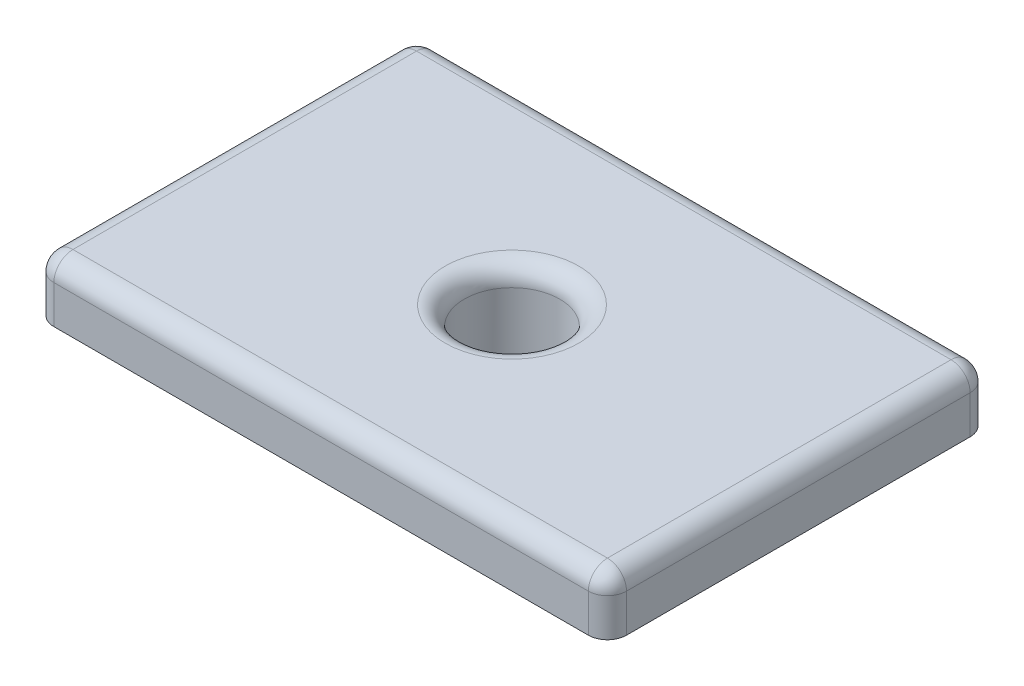
ISO-10303-21;
HEADER;
FILE_DESCRIPTION(('STEP AP214'),'2;1');
FILE_NAME('part.step','',(''),(''),'','','');
FILE_SCHEMA(('AUTOMOTIVE_DESIGN { 1 0 10303 214 1 1 1 1 }'));
ENDSEC;
DATA;
#1=APPLICATION_CONTEXT('core data for automotive mechanical design processes');
#2=APPLICATION_PROTOCOL_DEFINITION('international standard','automotive_design',2000,#1);
#3=PRODUCT_CONTEXT('',#1,'mechanical');
#4=PRODUCT('Part','Part','',(#3));
#5=PRODUCT_RELATED_PRODUCT_CATEGORY('part','',(#4));
#6=PRODUCT_DEFINITION_FORMATION('','',#4);
#7=PRODUCT_DEFINITION_CONTEXT('part definition',#1,'design');
#8=PRODUCT_DEFINITION('design','',#6,#7);
#9=PRODUCT_DEFINITION_SHAPE('','',#8);
#10=(LENGTH_UNIT() NAMED_UNIT(*) SI_UNIT(.MILLI.,.METRE.));
#11=(NAMED_UNIT(*) PLANE_ANGLE_UNIT() SI_UNIT($,.RADIAN.));
#12=(NAMED_UNIT(*) SI_UNIT($,.STERADIAN.) SOLID_ANGLE_UNIT());
#13=UNCERTAINTY_MEASURE_WITH_UNIT(LENGTH_MEASURE(1.E-05),#10,'distance_accuracy_value','');
#14=(GEOMETRIC_REPRESENTATION_CONTEXT(3) GLOBAL_UNCERTAINTY_ASSIGNED_CONTEXT((#13)) GLOBAL_UNIT_ASSIGNED_CONTEXT((#10,
#11,#12)) REPRESENTATION_CONTEXT('',''));
#15=CARTESIAN_POINT('',(0.,0.,0.));
#16=DIRECTION('',(0.,0.,1.));
#17=DIRECTION('',(1.,0.,0.));
#18=AXIS2_PLACEMENT_3D('',#15,#16,#17);
#19=CARTESIAN_POINT('',(5.43818539233098,2.67462627726309,3.13766362557271));
#20=DIRECTION('',(0.,1.,0.));
#21=DIRECTION('',(0.,0.,1.));
#22=AXIS2_PLACEMENT_3D('',#19,#20,#21);
#23=PLANE('',#22);
#24=CARTESIAN_POINT('',(5.43818539233098,2.67462627726309,3.13766362557271));
#25=DIRECTION('',(0.,1.,0.));
#26=DIRECTION('',(0.,0.,1.));
#27=AXIS2_PLACEMENT_3D('',#24,#25,#26);
#28=CIRCLE('',#27,0.5);
#29=CARTESIAN_POINT('',(5.43818539233098,2.67462627726309,3.63766362557271));
#30=VERTEX_POINT('',#29);
#31=CARTESIAN_POINT('',(5.93818539233098,2.67462627726309,3.13766362557271));
#32=VERTEX_POINT('',#31);
#33=EDGE_CURVE('E112',#30,#32,#28,.T.);
#34=ORIENTED_EDGE('',*,*,#33,.F.);
#35=DIRECTION('',(1.,0.,0.));
#36=VECTOR('',#35,1.);
#37=CARTESIAN_POINT('',(-8.56181460766902,2.67462627726309,3.63766362557271));
#38=LINE('',#37,#36);
#39=CARTESIAN_POINT('',(-8.56181460766902,2.67462627726309,3.63766362557271));
#40=VERTEX_POINT('',#39);
#41=EDGE_CURVE('E141',#40,#30,#38,.T.);
#42=ORIENTED_EDGE('',*,*,#41,.F.);
#43=CARTESIAN_POINT('',(-8.56181460766902,2.67462627726309,3.13766362557271));
#44=DIRECTION('',(0.,1.,0.));
#45=DIRECTION('',(0.,0.,1.));
#46=AXIS2_PLACEMENT_3D('',#43,#44,#45);
#47=CIRCLE('',#46,0.5);
#48=CARTESIAN_POINT('',(-9.06181460766902,2.67462627726309,3.13766362557271));
#49=VERTEX_POINT('',#48);
#50=EDGE_CURVE('E138',#49,#40,#47,.T.);
#51=ORIENTED_EDGE('',*,*,#50,.F.);
#52=DIRECTION('',(0.,0.,1.));
#53=VECTOR('',#52,1.);
#54=CARTESIAN_POINT('',(-9.06181460766902,2.67462627726309,-5.86233637442728));
#55=LINE('',#54,#53);
#56=CARTESIAN_POINT('',(-9.06181460766902,2.67462627726309,-5.86233637442728));
#57=VERTEX_POINT('',#56);
#58=EDGE_CURVE('E135',#57,#49,#55,.T.);
#59=ORIENTED_EDGE('',*,*,#58,.F.);
#60=CARTESIAN_POINT('',(-8.56181460766902,2.67462627726309,-5.86233637442729));
#61=DIRECTION('',(0.,1.,0.));
#62=DIRECTION('',(0.,0.,1.));
#63=AXIS2_PLACEMENT_3D('',#60,#61,#62);
#64=CIRCLE('',#63,0.5);
#65=CARTESIAN_POINT('',(-8.56181460766902,2.67462627726309,-6.36233637442729));
#66=VERTEX_POINT('',#65);
#67=EDGE_CURVE('E132',#66,#57,#64,.T.);
#68=ORIENTED_EDGE('',*,*,#67,.F.);
#69=DIRECTION('',(-1.,0.,0.));
#70=VECTOR('',#69,1.);
#71=CARTESIAN_POINT('',(-8.56181460766902,2.67462627726309,-6.36233637442729));
#72=LINE('',#71,#70);
#73=CARTESIAN_POINT('',(5.43818539233097,2.67462627726309,-6.36233637442729));
#74=VERTEX_POINT('',#73);
#75=EDGE_CURVE('E129',#74,#66,#72,.T.);
#76=ORIENTED_EDGE('',*,*,#75,.F.);
#77=CARTESIAN_POINT('',(5.43818539233098,2.67462627726309,-5.86233637442729));
#78=DIRECTION('',(0.,1.,0.));
#79=DIRECTION('',(0.,0.,-1.));
#80=AXIS2_PLACEMENT_3D('',#77,#78,#79);
#81=CIRCLE('',#80,0.5);
#82=CARTESIAN_POINT('',(5.93818539233098,2.67462627726309,-5.86233637442728));
#83=VERTEX_POINT('',#82);
#84=EDGE_CURVE('E115',#83,#74,#81,.T.);
#85=ORIENTED_EDGE('',*,*,#84,.F.);
#86=DIRECTION('',(0.,0.,-1.));
#87=VECTOR('',#86,1.);
#88=CARTESIAN_POINT('',(5.93818539233098,2.67462627726309,-5.86233637442728));
#89=LINE('',#88,#87);
#90=EDGE_CURVE('E98',#32,#83,#89,.T.);
#91=ORIENTED_EDGE('',*,*,#90,.F.);
#92=EDGE_LOOP('',(#34,#42,#51,#59,#68,#76,#85,#91));
#93=FACE_BOUND('',#92,.T.);
#94=CARTESIAN_POINT('',(-1.56181460766902,2.67462627726309,-1.36233637442728));
#95=DIRECTION('',(0.,1.,0.));
#96=DIRECTION('',(0.,0.,1.));
#97=AXIS2_PLACEMENT_3D('',#94,#95,#96);
#98=CIRCLE('',#97,3.);
#99=CARTESIAN_POINT('',(-1.56181460766902,2.67462627726309,1.63766362557272));
#100=VERTEX_POINT('',#99);
#101=EDGE_CURVE('E105',#100,#100,#98,.F.);
#102=ORIENTED_EDGE('',*,*,#101,.F.);
#103=EDGE_LOOP('',(#102));
#104=FACE_BOUND('',#103,.T.);
#105=ADVANCED_FACE('F16',(#93,#104),#23,.F.);
#106=CARTESIAN_POINT('',(5.43818539233098,4.17462627726309,3.13766362557271));
#107=DIRECTION('',(0.,-1.,0.));
#108=DIRECTION('',(0.,0.,-1.));
#109=AXIS2_PLACEMENT_3D('',#106,#107,#108);
#110=CYLINDRICAL_SURFACE('',#109,0.5);
#111=DIRECTION('',(0.,-1.,0.));
#112=VECTOR('',#111,1.);
#113=CARTESIAN_POINT('',(5.93818539233098,4.17462627726309,3.13766362557271));
#114=LINE('',#113,#112);
#115=CARTESIAN_POINT('',(5.93818539233098,3.67462627726309,3.13766362557271));
#116=VERTEX_POINT('',#115);
#117=EDGE_CURVE('E94',#116,#32,#114,.T.);
#118=ORIENTED_EDGE('',*,*,#117,.F.);
#119=CARTESIAN_POINT('',(5.43818539233098,3.67462627726309,3.13766362557271));
#120=DIRECTION('',(0.,-1.,0.));
#121=DIRECTION('',(0.,0.,-1.));
#122=AXIS2_PLACEMENT_3D('',#119,#120,#121);
#123=CIRCLE('',#122,0.5);
#124=CARTESIAN_POINT('',(5.43818539233098,3.67462627726309,3.63766362557271));
#125=VERTEX_POINT('',#124);
#126=EDGE_CURVE('E170',#116,#125,#123,.T.);
#127=ORIENTED_EDGE('',*,*,#126,.T.);
#128=DIRECTION('',(0.,-1.,0.));
#129=VECTOR('',#128,1.);
#130=CARTESIAN_POINT('',(5.43818539233098,4.17462627726309,3.63766362557271));
#131=LINE('',#130,#129);
#132=EDGE_CURVE('E119',#125,#30,#131,.T.);
#133=ORIENTED_EDGE('',*,*,#132,.T.);
#134=ORIENTED_EDGE('',*,*,#33,.T.);
#135=EDGE_LOOP('',(#118,#127,#133,#134));
#136=FACE_BOUND('',#135,.T.);
#137=ADVANCED_FACE('F117',(#136),#110,.T.);
#138=CARTESIAN_POINT('',(5.93818539233098,4.17462627726309,-5.86233637442728));
#139=DIRECTION('',(-1.,0.,0.));
#140=DIRECTION('',(0.,0.,1.));
#141=AXIS2_PLACEMENT_3D('',#138,#139,#140);
#142=PLANE('',#141);
#143=DIRECTION('',(0.,-1.,0.));
#144=VECTOR('',#143,1.);
#145=CARTESIAN_POINT('',(5.93818539233098,4.17462627726309,-5.86233637442728));
#146=LINE('',#145,#144);
#147=CARTESIAN_POINT('',(5.93818539233098,3.67462627726309,-5.86233637442728));
#148=VERTEX_POINT('',#147);
#149=EDGE_CURVE('E106',#148,#83,#146,.T.);
#150=ORIENTED_EDGE('',*,*,#149,.F.);
#151=DIRECTION('',(0.,0.,-1.));
#152=VECTOR('',#151,1.);
#153=CARTESIAN_POINT('',(5.93818539233098,3.67462627726309,3.13766362557271));
#154=LINE('',#153,#152);
#155=EDGE_CURVE('E101',#148,#116,#154,.F.);
#156=ORIENTED_EDGE('',*,*,#155,.T.);
#157=ORIENTED_EDGE('',*,*,#117,.T.);
#158=ORIENTED_EDGE('',*,*,#90,.T.);
#159=EDGE_LOOP('',(#150,#156,#157,#158));
#160=FACE_BOUND('',#159,.T.);
#161=ADVANCED_FACE('F97',(#160),#142,.F.);
#162=CARTESIAN_POINT('',(5.43818539233098,4.17462627726309,-5.86233637442729));
#163=DIRECTION('',(0.,-1.,0.));
#164=DIRECTION('',(0.,0.,-1.));
#165=AXIS2_PLACEMENT_3D('',#162,#163,#164);
#166=CYLINDRICAL_SURFACE('',#165,0.5);
#167=DIRECTION('',(0.,-1.,0.));
#168=VECTOR('',#167,1.);
#169=CARTESIAN_POINT('',(5.43818539233097,4.17462627726309,-6.36233637442729));
#170=LINE('',#169,#168);
#171=CARTESIAN_POINT('',(5.43818539233097,3.67462627726309,-6.36233637442729));
#172=VERTEX_POINT('',#171);
#173=EDGE_CURVE('E152',#172,#74,#170,.T.);
#174=ORIENTED_EDGE('',*,*,#173,.F.);
#175=CARTESIAN_POINT('',(5.43818539233098,3.67462627726309,-5.86233637442729));
#176=DIRECTION('',(0.,-1.,0.));
#177=DIRECTION('',(0.,0.,-1.));
#178=AXIS2_PLACEMENT_3D('',#175,#176,#177);
#179=CIRCLE('',#178,0.5);
#180=EDGE_CURVE('E157',#172,#148,#179,.T.);
#181=ORIENTED_EDGE('',*,*,#180,.T.);
#182=ORIENTED_EDGE('',*,*,#149,.T.);
#183=ORIENTED_EDGE('',*,*,#84,.T.);
#184=EDGE_LOOP('',(#174,#181,#182,#183));
#185=FACE_BOUND('',#184,.T.);
#186=ADVANCED_FACE('F245',(#185),#166,.T.);
#187=CARTESIAN_POINT('',(-8.56181460766902,4.17462627726309,-6.36233637442729));
#188=DIRECTION('',(0.,0.,1.));
#189=DIRECTION('',(1.,0.,0.));
#190=AXIS2_PLACEMENT_3D('',#187,#188,#189);
#191=PLANE('',#190);
#192=DIRECTION('',(0.,-1.,0.));
#193=VECTOR('',#192,1.);
#194=CARTESIAN_POINT('',(-8.56181460766902,4.17462627726309,-6.36233637442729));
#195=LINE('',#194,#193);
#196=CARTESIAN_POINT('',(-8.56181460766902,3.67462627726309,-6.36233637442729));
#197=VERTEX_POINT('',#196);
#198=EDGE_CURVE('E150',#197,#66,#195,.T.);
#199=ORIENTED_EDGE('',*,*,#198,.F.);
#200=DIRECTION('',(-1.,0.,0.));
#201=VECTOR('',#200,1.);
#202=CARTESIAN_POINT('',(5.43818539233097,3.67462627726309,-6.36233637442729));
#203=LINE('',#202,#201);
#204=EDGE_CURVE('E178',#197,#172,#203,.F.);
#205=ORIENTED_EDGE('',*,*,#204,.T.);
#206=ORIENTED_EDGE('',*,*,#173,.T.);
#207=ORIENTED_EDGE('',*,*,#75,.T.);
#208=EDGE_LOOP('',(#199,#205,#206,#207));
#209=FACE_BOUND('',#208,.T.);
#210=ADVANCED_FACE('F242',(#209),#191,.F.);
#211=CARTESIAN_POINT('',(-8.56181460766902,4.17462627726309,-5.86233637442729));
#212=DIRECTION('',(0.,-1.,0.));
#213=DIRECTION('',(0.,0.,-1.));
#214=AXIS2_PLACEMENT_3D('',#211,#212,#213);
#215=CYLINDRICAL_SURFACE('',#214,0.5);
#216=DIRECTION('',(0.,-1.,0.));
#217=VECTOR('',#216,1.);
#218=CARTESIAN_POINT('',(-9.06181460766902,4.17462627726309,-5.86233637442728));
#219=LINE('',#218,#217);
#220=CARTESIAN_POINT('',(-9.06181460766902,3.67462627726309,-5.86233637442728));
#221=VERTEX_POINT('',#220);
#222=EDGE_CURVE('E148',#221,#57,#219,.T.);
#223=ORIENTED_EDGE('',*,*,#222,.F.);
#224=CARTESIAN_POINT('',(-8.56181460766902,3.67462627726309,-5.86233637442729));
#225=DIRECTION('',(0.,-1.,0.));
#226=DIRECTION('',(0.,0.,-1.));
#227=AXIS2_PLACEMENT_3D('',#224,#225,#226);
#228=CIRCLE('',#227,0.5);
#229=EDGE_CURVE('E31',#221,#197,#228,.T.);
#230=ORIENTED_EDGE('',*,*,#229,.T.);
#231=ORIENTED_EDGE('',*,*,#198,.T.);
#232=ORIENTED_EDGE('',*,*,#67,.T.);
#233=EDGE_LOOP('',(#223,#230,#231,#232));
#234=FACE_BOUND('',#233,.T.);
#235=ADVANCED_FACE('F239',(#234),#215,.T.);
#236=CARTESIAN_POINT('',(-9.06181460766902,4.17462627726309,-5.86233637442728));
#237=DIRECTION('',(1.,0.,0.));
#238=DIRECTION('',(0.,0.,-1.));
#239=AXIS2_PLACEMENT_3D('',#236,#237,#238);
#240=PLANE('',#239);
#241=DIRECTION('',(0.,-1.,0.));
#242=VECTOR('',#241,1.);
#243=CARTESIAN_POINT('',(-9.06181460766902,4.17462627726309,3.13766362557271));
#244=LINE('',#243,#242);
#245=CARTESIAN_POINT('',(-9.06181460766902,3.67462627726309,3.13766362557271));
#246=VERTEX_POINT('',#245);
#247=EDGE_CURVE('E146',#246,#49,#244,.T.);
#248=ORIENTED_EDGE('',*,*,#247,.F.);
#249=DIRECTION('',(0.,0.,1.));
#250=VECTOR('',#249,1.);
#251=CARTESIAN_POINT('',(-9.06181460766902,3.67462627726309,-5.86233637442728));
#252=LINE('',#251,#250);
#253=EDGE_CURVE('E39',#246,#221,#252,.F.);
#254=ORIENTED_EDGE('',*,*,#253,.T.);
#255=ORIENTED_EDGE('',*,*,#222,.T.);
#256=ORIENTED_EDGE('',*,*,#58,.T.);
#257=EDGE_LOOP('',(#248,#254,#255,#256));
#258=FACE_BOUND('',#257,.T.);
#259=ADVANCED_FACE('F235',(#258),#240,.F.);
#260=CARTESIAN_POINT('',(-8.56181460766902,4.17462627726309,3.13766362557271));
#261=DIRECTION('',(0.,-1.,0.));
#262=DIRECTION('',(0.,0.,-1.));
#263=AXIS2_PLACEMENT_3D('',#260,#261,#262);
#264=CYLINDRICAL_SURFACE('',#263,0.5);
#265=DIRECTION('',(0.,-1.,0.));
#266=VECTOR('',#265,1.);
#267=CARTESIAN_POINT('',(-8.56181460766902,4.17462627726309,3.63766362557271));
#268=LINE('',#267,#266);
#269=CARTESIAN_POINT('',(-8.56181460766902,3.67462627726309,3.63766362557271));
#270=VERTEX_POINT('',#269);
#271=EDGE_CURVE('E144',#270,#40,#268,.T.);
#272=ORIENTED_EDGE('',*,*,#271,.F.);
#273=CARTESIAN_POINT('',(-8.56181460766902,3.67462627726309,3.13766362557271));
#274=DIRECTION('',(0.,-1.,0.));
#275=DIRECTION('',(0.,0.,-1.));
#276=AXIS2_PLACEMENT_3D('',#273,#274,#275);
#277=CIRCLE('',#276,0.5);
#278=EDGE_CURVE('E174',#270,#246,#277,.T.);
#279=ORIENTED_EDGE('',*,*,#278,.T.);
#280=ORIENTED_EDGE('',*,*,#247,.T.);
#281=ORIENTED_EDGE('',*,*,#50,.T.);
#282=EDGE_LOOP('',(#272,#279,#280,#281));
#283=FACE_BOUND('',#282,.T.);
#284=ADVANCED_FACE('F231',(#283),#264,.T.);
#285=CARTESIAN_POINT('',(-8.56181460766902,4.17462627726309,3.63766362557271));
#286=DIRECTION('',(0.,0.,-1.));
#287=DIRECTION('',(-1.,0.,0.));
#288=AXIS2_PLACEMENT_3D('',#285,#286,#287);
#289=PLANE('',#288);
#290=ORIENTED_EDGE('',*,*,#132,.F.);
#291=DIRECTION('',(1.,0.,0.));
#292=VECTOR('',#291,1.);
#293=CARTESIAN_POINT('',(-8.56181460766902,3.67462627726309,3.63766362557271));
#294=LINE('',#293,#292);
#295=EDGE_CURVE('E172',#125,#270,#294,.F.);
#296=ORIENTED_EDGE('',*,*,#295,.T.);
#297=ORIENTED_EDGE('',*,*,#271,.T.);
#298=ORIENTED_EDGE('',*,*,#41,.T.);
#299=EDGE_LOOP('',(#290,#296,#297,#298));
#300=FACE_BOUND('',#299,.T.);
#301=ADVANCED_FACE('F228',(#300),#289,.F.);
#302=CARTESIAN_POINT('',(5.43818539233098,4.17462627726309,3.13766362557271));
#303=DIRECTION('',(0.,1.,0.));
#304=DIRECTION('',(0.,0.,1.));
#305=AXIS2_PLACEMENT_3D('',#302,#303,#304);
#306=PLANE('',#305);
#307=CARTESIAN_POINT('',(-1.56181460766902,4.17462627726309,-1.36233637442728));
#308=DIRECTION('',(0.,1.,0.));
#309=DIRECTION('',(0.,0.,1.));
#310=AXIS2_PLACEMENT_3D('',#307,#308,#309);
#311=CIRCLE('',#310,1.75);
#312=CARTESIAN_POINT('',(-1.56181460766902,4.17462627726309,0.387663625572715));
#313=VERTEX_POINT('',#312);
#314=EDGE_CURVE('E10',#313,#313,#311,.F.);
#315=ORIENTED_EDGE('',*,*,#314,.T.);
#316=EDGE_LOOP('',(#315));
#317=FACE_BOUND('',#316,.T.);
#318=DIRECTION('',(1.,0.,0.));
#319=VECTOR('',#318,1.);
#320=CARTESIAN_POINT('',(5.43818539233098,4.17462627726309,3.13766362557271));
#321=LINE('',#320,#319);
#322=CARTESIAN_POINT('',(-8.56181460766902,4.17462627726309,3.13766362557271));
#323=VERTEX_POINT('',#322);
#324=CARTESIAN_POINT('',(5.43818539233098,4.17462627726309,3.13766362557271));
#325=VERTEX_POINT('',#324);
#326=EDGE_CURVE('E164',#323,#325,#321,.T.);
#327=ORIENTED_EDGE('',*,*,#326,.T.);
#328=DIRECTION('',(0.,0.,-1.));
#329=VECTOR('',#328,1.);
#330=CARTESIAN_POINT('',(5.43818539233098,4.17462627726309,-5.86233637442728));
#331=LINE('',#330,#329);
#332=CARTESIAN_POINT('',(5.43818539233098,4.17462627726309,-5.86233637442729));
#333=VERTEX_POINT('',#332);
#334=EDGE_CURVE('E166',#325,#333,#331,.T.);
#335=ORIENTED_EDGE('',*,*,#334,.T.);
#336=DIRECTION('',(-1.,0.,0.));
#337=VECTOR('',#336,1.);
#338=CARTESIAN_POINT('',(-8.56181460766902,4.17462627726309,-5.86233637442729));
#339=LINE('',#338,#337);
#340=CARTESIAN_POINT('',(-8.56181460766902,4.17462627726309,-5.86233637442729));
#341=VERTEX_POINT('',#340);
#342=EDGE_CURVE('E160',#333,#341,#339,.T.);
#343=ORIENTED_EDGE('',*,*,#342,.T.);
#344=DIRECTION('',(0.,0.,1.));
#345=VECTOR('',#344,1.);
#346=CARTESIAN_POINT('',(-8.56181460766902,4.17462627726309,3.13766362557271));
#347=LINE('',#346,#345);
#348=EDGE_CURVE('E162',#341,#323,#347,.T.);
#349=ORIENTED_EDGE('',*,*,#348,.T.);
#350=EDGE_LOOP('',(#327,#335,#343,#349));
#351=FACE_BOUND('',#350,.T.);
#352=ADVANCED_FACE('F226',(#317,#351),#306,.T.);
#353=CARTESIAN_POINT('',(-1.56181460766902,2.67462627726309,-1.36233637442728));
#354=DIRECTION('',(0.,1.,0.));
#355=DIRECTION('',(0.,0.,1.));
#356=AXIS2_PLACEMENT_3D('',#353,#354,#355);
#357=CYLINDRICAL_SURFACE('',#356,1.25);
#358=CARTESIAN_POINT('',(-1.56181460766902,3.67462627726309,-1.36233637442728));
#359=DIRECTION('',(0.,1.,0.));
#360=DIRECTION('',(0.,0.,1.));
#361=AXIS2_PLACEMENT_3D('',#358,#359,#360);
#362=CIRCLE('',#361,1.25);
#363=CARTESIAN_POINT('',(-1.56181460766902,3.67462627726309,-0.112336374427285));
#364=VERTEX_POINT('',#363);
#365=EDGE_CURVE('E24',#364,#364,#362,.T.);
#366=ORIENTED_EDGE('',*,*,#365,.T.);
#367=EDGE_LOOP('',(#366));
#368=FACE_BOUND('',#367,.T.);
#369=CARTESIAN_POINT('',(-1.56181460766902,1.67462627726309,-1.36233637442728));
#370=DIRECTION('',(0.,-1.,0.));
#371=DIRECTION('',(0.,0.,-1.));
#372=AXIS2_PLACEMENT_3D('',#369,#370,#371);
#373=CIRCLE('',#372,1.25);
#374=CARTESIAN_POINT('',(-1.56181460766902,1.67462627726309,-2.61233637442729));
#375=VERTEX_POINT('',#374);
#376=EDGE_CURVE('E124',#375,#375,#373,.T.);
#377=ORIENTED_EDGE('',*,*,#376,.T.);
#378=EDGE_LOOP('',(#377));
#379=FACE_BOUND('',#378,.T.);
#380=ADVANCED_FACE('F204',(#368,#379),#357,.F.);
#381=CARTESIAN_POINT('',(-1.56181460766902,1.67462627726309,-1.36233637442728));
#382=DIRECTION('',(0.,-1.,0.));
#383=DIRECTION('',(0.,0.,-1.));
#384=AXIS2_PLACEMENT_3D('',#381,#382,#383);
#385=PLANE('',#384);
#386=CARTESIAN_POINT('',(-1.56181460766902,1.67462627726309,-1.36233637442728));
#387=DIRECTION('',(0.,-1.,0.));
#388=DIRECTION('',(0.,0.,-1.));
#389=AXIS2_PLACEMENT_3D('',#386,#387,#388);
#390=CIRCLE('',#389,3.);
#391=CARTESIAN_POINT('',(-1.56181460766902,1.67462627726309,-4.36233637442729));
#392=VERTEX_POINT('',#391);
#393=EDGE_CURVE('E121',#392,#392,#390,.T.);
#394=ORIENTED_EDGE('',*,*,#393,.T.);
#395=EDGE_LOOP('',(#394));
#396=FACE_BOUND('',#395,.T.);
#397=ORIENTED_EDGE('',*,*,#376,.F.);
#398=EDGE_LOOP('',(#397));
#399=FACE_BOUND('',#398,.T.);
#400=ADVANCED_FACE('F281',(#396,#399),#385,.T.);
#401=CARTESIAN_POINT('',(-1.56181460766902,1.67462627726309,-1.36233637442728));
#402=DIRECTION('',(0.,1.,0.));
#403=DIRECTION('',(0.,0.,1.));
#404=AXIS2_PLACEMENT_3D('',#401,#402,#403);
#405=CYLINDRICAL_SURFACE('',#404,3.);
#406=ORIENTED_EDGE('',*,*,#393,.F.);
#407=EDGE_LOOP('',(#406));
#408=FACE_BOUND('',#407,.T.);
#409=ORIENTED_EDGE('',*,*,#101,.T.);
#410=EDGE_LOOP('',(#409));
#411=FACE_BOUND('',#410,.T.);
#412=ADVANCED_FACE('F276',(#408,#411),#405,.T.);
#413=CARTESIAN_POINT('',(-8.56181460766902,3.67462627726309,3.13766362557271));
#414=DIRECTION('',(0.,0.,1.));
#415=DIRECTION('',(1.,0.,0.));
#416=AXIS2_PLACEMENT_3D('',#413,#414,#415);
#417=SPHERICAL_SURFACE('',#416,0.5);
#418=CARTESIAN_POINT('',(-8.56181460766902,3.67462627726309,3.13766362557271));
#419=DIRECTION('',(0.,0.,-1.));
#420=DIRECTION('',(-1.,0.,0.));
#421=AXIS2_PLACEMENT_3D('',#418,#419,#420);
#422=CIRCLE('',#421,0.5);
#423=EDGE_CURVE('E196',#246,#323,#422,.T.);
#424=ORIENTED_EDGE('',*,*,#423,.F.);
#425=ORIENTED_EDGE('',*,*,#278,.F.);
#426=CARTESIAN_POINT('',(-8.56181460766902,3.67462627726309,3.13766362557271));
#427=DIRECTION('',(1.,0.,0.));
#428=DIRECTION('',(0.,0.,-1.));
#429=AXIS2_PLACEMENT_3D('',#426,#427,#428);
#430=CIRCLE('',#429,0.5);
#431=EDGE_CURVE('E199',#323,#270,#430,.T.);
#432=ORIENTED_EDGE('',*,*,#431,.F.);
#433=EDGE_LOOP('',(#424,#425,#432));
#434=FACE_BOUND('',#433,.T.);
#435=ADVANCED_FACE('F273',(#434),#417,.T.);
#436=CARTESIAN_POINT('',(5.43818539233098,3.67462627726309,3.13766362557271));
#437=DIRECTION('',(-1.,0.,0.));
#438=DIRECTION('',(0.,0.,1.));
#439=AXIS2_PLACEMENT_3D('',#436,#437,#438);
#440=CYLINDRICAL_SURFACE('',#439,0.5);
#441=ORIENTED_EDGE('',*,*,#431,.T.);
#442=ORIENTED_EDGE('',*,*,#295,.F.);
#443=CARTESIAN_POINT('',(5.43818539233098,3.67462627726309,3.13766362557271));
#444=DIRECTION('',(1.,0.,0.));
#445=DIRECTION('',(0.,0.,-1.));
#446=AXIS2_PLACEMENT_3D('',#443,#444,#445);
#447=CIRCLE('',#446,0.5);
#448=EDGE_CURVE('E193',#325,#125,#447,.T.);
#449=ORIENTED_EDGE('',*,*,#448,.F.);
#450=ORIENTED_EDGE('',*,*,#326,.F.);
#451=EDGE_LOOP('',(#441,#442,#449,#450));
#452=FACE_BOUND('',#451,.T.);
#453=ADVANCED_FACE('F270',(#452),#440,.T.);
#454=CARTESIAN_POINT('',(-8.56181460766902,3.67462627726309,3.13766362557272));
#455=DIRECTION('',(0.,0.,-1.));
#456=DIRECTION('',(-1.,0.,0.));
#457=AXIS2_PLACEMENT_3D('',#454,#455,#456);
#458=CYLINDRICAL_SURFACE('',#457,0.5);
#459=ORIENTED_EDGE('',*,*,#423,.T.);
#460=ORIENTED_EDGE('',*,*,#348,.F.);
#461=CARTESIAN_POINT('',(-8.56181460766902,3.67462627726309,-5.86233637442728));
#462=DIRECTION('',(0.,0.,-1.));
#463=DIRECTION('',(-1.,0.,0.));
#464=AXIS2_PLACEMENT_3D('',#461,#462,#463);
#465=CIRCLE('',#464,0.5);
#466=EDGE_CURVE('E190',#221,#341,#465,.T.);
#467=ORIENTED_EDGE('',*,*,#466,.F.);
#468=ORIENTED_EDGE('',*,*,#253,.F.);
#469=EDGE_LOOP('',(#459,#460,#467,#468));
#470=FACE_BOUND('',#469,.T.);
#471=ADVANCED_FACE('F266',(#470),#458,.T.);
#472=CARTESIAN_POINT('',(5.43818539233098,3.67462627726309,3.13766362557271));
#473=DIRECTION('',(0.,0.,1.));
#474=DIRECTION('',(1.,0.,0.));
#475=AXIS2_PLACEMENT_3D('',#472,#473,#474);
#476=SPHERICAL_SURFACE('',#475,0.5);
#477=ORIENTED_EDGE('',*,*,#448,.T.);
#478=ORIENTED_EDGE('',*,*,#126,.F.);
#479=CARTESIAN_POINT('',(5.43818539233098,3.67462627726309,3.13766362557271));
#480=DIRECTION('',(0.,0.,-1.));
#481=DIRECTION('',(-1.,0.,0.));
#482=AXIS2_PLACEMENT_3D('',#479,#480,#481);
#483=CIRCLE('',#482,0.5);
#484=EDGE_CURVE('E187',#325,#116,#483,.T.);
#485=ORIENTED_EDGE('',*,*,#484,.F.);
#486=EDGE_LOOP('',(#477,#478,#485));
#487=FACE_BOUND('',#486,.T.);
#488=ADVANCED_FACE('F262',(#487),#476,.T.);
#489=CARTESIAN_POINT('',(-8.56181460766902,3.67462627726309,-5.86233637442729));
#490=DIRECTION('',(0.,0.,1.));
#491=DIRECTION('',(1.,0.,0.));
#492=AXIS2_PLACEMENT_3D('',#489,#490,#491);
#493=SPHERICAL_SURFACE('',#492,0.5);
#494=ORIENTED_EDGE('',*,*,#229,.F.);
#495=ORIENTED_EDGE('',*,*,#466,.T.);
#496=CARTESIAN_POINT('',(-8.56181460766902,3.67462627726309,-5.86233637442729));
#497=DIRECTION('',(1.,0.,0.));
#498=DIRECTION('',(0.,0.,-1.));
#499=AXIS2_PLACEMENT_3D('',#496,#497,#498);
#500=CIRCLE('',#499,0.5);
#501=EDGE_CURVE('E184',#197,#341,#500,.T.);
#502=ORIENTED_EDGE('',*,*,#501,.F.);
#503=EDGE_LOOP('',(#494,#495,#502));
#504=FACE_BOUND('',#503,.T.);
#505=ADVANCED_FACE('F258',(#504),#493,.T.);
#506=CARTESIAN_POINT('',(5.43818539233098,3.67462627726309,3.13766362557271));
#507=DIRECTION('',(0.,0.,1.));
#508=DIRECTION('',(1.,0.,0.));
#509=AXIS2_PLACEMENT_3D('',#506,#507,#508);
#510=CYLINDRICAL_SURFACE('',#509,0.5);
#511=ORIENTED_EDGE('',*,*,#484,.T.);
#512=ORIENTED_EDGE('',*,*,#155,.F.);
#513=CARTESIAN_POINT('',(5.43818539233098,3.67462627726309,-5.86233637442729));
#514=DIRECTION('',(0.,0.,-1.));
#515=DIRECTION('',(-1.,0.,0.));
#516=AXIS2_PLACEMENT_3D('',#513,#514,#515);
#517=CIRCLE('',#516,0.5);
#518=EDGE_CURVE('E182',#333,#148,#517,.T.);
#519=ORIENTED_EDGE('',*,*,#518,.F.);
#520=ORIENTED_EDGE('',*,*,#334,.F.);
#521=EDGE_LOOP('',(#511,#512,#519,#520));
#522=FACE_BOUND('',#521,.T.);
#523=ADVANCED_FACE('F254',(#522),#510,.T.);
#524=CARTESIAN_POINT('',(5.43818539233098,3.67462627726309,-5.86233637442729));
#525=DIRECTION('',(1.,0.,0.));
#526=DIRECTION('',(0.,0.,-1.));
#527=AXIS2_PLACEMENT_3D('',#524,#525,#526);
#528=CYLINDRICAL_SURFACE('',#527,0.5);
#529=ORIENTED_EDGE('',*,*,#501,.T.);
#530=ORIENTED_EDGE('',*,*,#342,.F.);
#531=CARTESIAN_POINT('',(5.43818539233097,3.67462627726309,-5.86233637442729));
#532=DIRECTION('',(1.,0.,0.));
#533=DIRECTION('',(0.,1.,0.));
#534=AXIS2_PLACEMENT_3D('',#531,#532,#533);
#535=CIRCLE('',#534,0.5);
#536=EDGE_CURVE('E180',#172,#333,#535,.T.);
#537=ORIENTED_EDGE('',*,*,#536,.F.);
#538=ORIENTED_EDGE('',*,*,#204,.F.);
#539=EDGE_LOOP('',(#529,#530,#537,#538));
#540=FACE_BOUND('',#539,.T.);
#541=ADVANCED_FACE('F214',(#540),#528,.T.);
#542=CARTESIAN_POINT('',(5.43818539233098,3.67462627726309,-5.86233637442729));
#543=DIRECTION('',(0.,0.,1.));
#544=DIRECTION('',(1.,0.,0.));
#545=AXIS2_PLACEMENT_3D('',#542,#543,#544);
#546=SPHERICAL_SURFACE('',#545,0.5);
#547=ORIENTED_EDGE('',*,*,#518,.T.);
#548=ORIENTED_EDGE('',*,*,#180,.F.);
#549=ORIENTED_EDGE('',*,*,#536,.T.);
#550=EDGE_LOOP('',(#547,#548,#549));
#551=FACE_BOUND('',#550,.T.);
#552=ADVANCED_FACE('F208',(#551),#546,.T.);
#553=CARTESIAN_POINT('',(-1.56181460766902,3.67462627726309,-1.36233637442728));
#554=DIRECTION('',(0.,1.,0.));
#555=DIRECTION('',(0.,0.,1.));
#556=AXIS2_PLACEMENT_3D('',#553,#554,#555);
#557=TOROIDAL_SURFACE('',#556,1.75,0.5);
#558=ORIENTED_EDGE('',*,*,#314,.F.);
#559=EDGE_LOOP('',(#558));
#560=FACE_BOUND('',#559,.T.);
#561=ORIENTED_EDGE('',*,*,#365,.F.);
#562=EDGE_LOOP('',(#561));
#563=FACE_BOUND('',#562,.T.);
#564=ADVANCED_FACE('F18',(#560,#563),#557,.T.);
#565=CLOSED_SHELL('',(#105,#137,#161,#186,#210,#235,#259,#284,#301,#352,#380,#400,#412,#435,
#453,#471,#488,#505,#523,#541,#552,#564));
#566=MANIFOLD_SOLID_BREP('B1',#565);
#567=ADVANCED_BREP_SHAPE_REPRESENTATION('',(#18,#566),#14);
#568=SHAPE_DEFINITION_REPRESENTATION(#9,#567);
ENDSEC;
END-ISO-10303-21;
